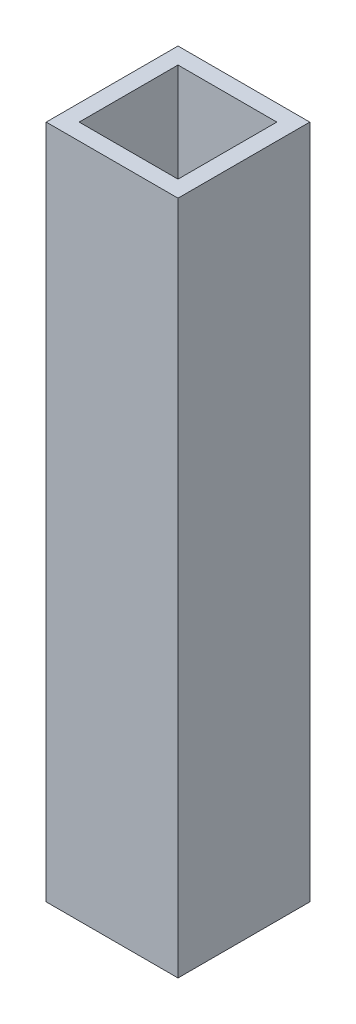
ISO-10303-21;
HEADER;
FILE_DESCRIPTION(('STEP AP214'),'2;1');
FILE_NAME('part.step','',(''),(''),'','','');
FILE_SCHEMA(('AUTOMOTIVE_DESIGN { 1 0 10303 214 1 1 1 1 }'));
ENDSEC;
DATA;
#1=APPLICATION_CONTEXT('core data for automotive mechanical design processes');
#2=APPLICATION_PROTOCOL_DEFINITION('international standard','automotive_design',2000,#1);
#3=PRODUCT_CONTEXT('',#1,'mechanical');
#4=PRODUCT('Part','Part','',(#3));
#5=PRODUCT_RELATED_PRODUCT_CATEGORY('part','',(#4));
#6=PRODUCT_DEFINITION_FORMATION('','',#4);
#7=PRODUCT_DEFINITION_CONTEXT('part definition',#1,'design');
#8=PRODUCT_DEFINITION('design','',#6,#7);
#9=PRODUCT_DEFINITION_SHAPE('','',#8);
#10=(LENGTH_UNIT() NAMED_UNIT(*) SI_UNIT(.MILLI.,.METRE.));
#11=(NAMED_UNIT(*) PLANE_ANGLE_UNIT() SI_UNIT($,.RADIAN.));
#12=(NAMED_UNIT(*) SI_UNIT($,.STERADIAN.) SOLID_ANGLE_UNIT());
#13=UNCERTAINTY_MEASURE_WITH_UNIT(LENGTH_MEASURE(1.E-05),#10,'distance_accuracy_value','');
#14=(GEOMETRIC_REPRESENTATION_CONTEXT(3) GLOBAL_UNCERTAINTY_ASSIGNED_CONTEXT((#13)) GLOBAL_UNIT_ASSIGNED_CONTEXT((#10,
#11,#12)) REPRESENTATION_CONTEXT('',''));
#15=CARTESIAN_POINT('',(0.,0.,0.));
#16=DIRECTION('',(0.,0.,1.));
#17=DIRECTION('',(1.,0.,0.));
#18=AXIS2_PLACEMENT_3D('',#15,#16,#17);
#19=CARTESIAN_POINT('',(0.,205.,0.));
#20=DIRECTION('',(0.,1.,0.));
#21=DIRECTION('',(0.,0.,1.));
#22=AXIS2_PLACEMENT_3D('',#19,#20,#21);
#23=PLANE('',#22);
#24=DIRECTION('',(0.,0.,1.));
#25=VECTOR('',#24,1.);
#26=CARTESIAN_POINT('',(-20.,205.,-20.));
#27=LINE('',#26,#25);
#28=CARTESIAN_POINT('',(-20.,205.,-20.));
#29=VERTEX_POINT('',#28);
#30=CARTESIAN_POINT('',(-20.,205.,20.));
#31=VERTEX_POINT('',#30);
#32=EDGE_CURVE('E138',#29,#31,#27,.T.);
#33=ORIENTED_EDGE('',*,*,#32,.T.);
#34=DIRECTION('',(1.,0.,0.));
#35=VECTOR('',#34,1.);
#36=CARTESIAN_POINT('',(-20.,205.,20.));
#37=LINE('',#36,#35);
#38=CARTESIAN_POINT('',(20.,205.,20.));
#39=VERTEX_POINT('',#38);
#40=EDGE_CURVE('E141',#31,#39,#37,.T.);
#41=ORIENTED_EDGE('',*,*,#40,.T.);
#42=DIRECTION('',(0.,0.,-1.));
#43=VECTOR('',#42,1.);
#44=CARTESIAN_POINT('',(20.,205.,-20.));
#45=LINE('',#44,#43);
#46=CARTESIAN_POINT('',(20.,205.,-20.));
#47=VERTEX_POINT('',#46);
#48=EDGE_CURVE('E144',#39,#47,#45,.T.);
#49=ORIENTED_EDGE('',*,*,#48,.T.);
#50=DIRECTION('',(-1.,0.,0.));
#51=VECTOR('',#50,1.);
#52=CARTESIAN_POINT('',(-20.,205.,-20.));
#53=LINE('',#52,#51);
#54=EDGE_CURVE('E146',#47,#29,#53,.T.);
#55=ORIENTED_EDGE('',*,*,#54,.T.);
#56=EDGE_LOOP('',(#33,#41,#49,#55));
#57=FACE_BOUND('',#56,.T.);
#58=DIRECTION('',(-1.,0.,0.));
#59=VECTOR('',#58,1.);
#60=CARTESIAN_POINT('',(-15.,205.,-15.));
#61=LINE('',#60,#59);
#62=CARTESIAN_POINT('',(15.,205.,-15.));
#63=VERTEX_POINT('',#62);
#64=CARTESIAN_POINT('',(-15.,205.,-15.));
#65=VERTEX_POINT('',#64);
#66=EDGE_CURVE('E110',#63,#65,#61,.T.);
#67=ORIENTED_EDGE('',*,*,#66,.F.);
#68=DIRECTION('',(0.,0.,-1.));
#69=VECTOR('',#68,1.);
#70=CARTESIAN_POINT('',(15.,205.,-15.));
#71=LINE('',#70,#69);
#72=CARTESIAN_POINT('',(15.,205.,15.));
#73=VERTEX_POINT('',#72);
#74=EDGE_CURVE('E102',#73,#63,#71,.T.);
#75=ORIENTED_EDGE('',*,*,#74,.F.);
#76=DIRECTION('',(1.,0.,0.));
#77=VECTOR('',#76,1.);
#78=CARTESIAN_POINT('',(-15.,205.,15.));
#79=LINE('',#78,#77);
#80=CARTESIAN_POINT('',(-15.,205.,15.));
#81=VERTEX_POINT('',#80);
#82=EDGE_CURVE('E124',#81,#73,#79,.T.);
#83=ORIENTED_EDGE('',*,*,#82,.F.);
#84=DIRECTION('',(0.,0.,1.));
#85=VECTOR('',#84,1.);
#86=CARTESIAN_POINT('',(-15.,205.,-15.));
#87=LINE('',#86,#85);
#88=EDGE_CURVE('E122',#65,#81,#87,.T.);
#89=ORIENTED_EDGE('',*,*,#88,.F.);
#90=EDGE_LOOP('',(#67,#75,#83,#89));
#91=FACE_BOUND('',#90,.T.);
#92=ADVANCED_FACE('F37',(#57,#91),#23,.T.);
#93=CARTESIAN_POINT('',(0.,0.,0.));
#94=DIRECTION('',(0.,1.,0.));
#95=DIRECTION('',(0.,0.,1.));
#96=AXIS2_PLACEMENT_3D('',#93,#94,#95);
#97=PLANE('',#96);
#98=DIRECTION('',(0.,0.,1.));
#99=VECTOR('',#98,1.);
#100=CARTESIAN_POINT('',(-20.,0.,-20.));
#101=LINE('',#100,#99);
#102=CARTESIAN_POINT('',(-20.,0.,-20.));
#103=VERTEX_POINT('',#102);
#104=CARTESIAN_POINT('',(-20.,0.,20.));
#105=VERTEX_POINT('',#104);
#106=EDGE_CURVE('E118',#103,#105,#101,.T.);
#107=ORIENTED_EDGE('',*,*,#106,.F.);
#108=DIRECTION('',(-1.,0.,0.));
#109=VECTOR('',#108,1.);
#110=CARTESIAN_POINT('',(-20.,0.,-20.));
#111=LINE('',#110,#109);
#112=CARTESIAN_POINT('',(20.,0.,-20.));
#113=VERTEX_POINT('',#112);
#114=EDGE_CURVE('E142',#113,#103,#111,.T.);
#115=ORIENTED_EDGE('',*,*,#114,.F.);
#116=DIRECTION('',(0.,0.,-1.));
#117=VECTOR('',#116,1.);
#118=CARTESIAN_POINT('',(20.,0.,-20.));
#119=LINE('',#118,#117);
#120=CARTESIAN_POINT('',(20.,0.,20.));
#121=VERTEX_POINT('',#120);
#122=EDGE_CURVE('E153',#121,#113,#119,.T.);
#123=ORIENTED_EDGE('',*,*,#122,.F.);
#124=DIRECTION('',(1.,0.,0.));
#125=VECTOR('',#124,1.);
#126=CARTESIAN_POINT('',(-20.,0.,20.));
#127=LINE('',#126,#125);
#128=EDGE_CURVE('E151',#105,#121,#127,.T.);
#129=ORIENTED_EDGE('',*,*,#128,.F.);
#130=EDGE_LOOP('',(#107,#115,#123,#129));
#131=FACE_BOUND('',#130,.T.);
#132=DIRECTION('',(0.,0.,-1.));
#133=VECTOR('',#132,1.);
#134=CARTESIAN_POINT('',(15.,0.,-15.));
#135=LINE('',#134,#133);
#136=CARTESIAN_POINT('',(15.,0.,15.));
#137=VERTEX_POINT('',#136);
#138=CARTESIAN_POINT('',(15.,0.,-15.));
#139=VERTEX_POINT('',#138);
#140=EDGE_CURVE('E60',#137,#139,#135,.T.);
#141=ORIENTED_EDGE('',*,*,#140,.T.);
#142=DIRECTION('',(-1.,0.,0.));
#143=VECTOR('',#142,1.);
#144=CARTESIAN_POINT('',(-15.,0.,-15.));
#145=LINE('',#144,#143);
#146=CARTESIAN_POINT('',(-15.,0.,-15.));
#147=VERTEX_POINT('',#146);
#148=EDGE_CURVE('E117',#139,#147,#145,.T.);
#149=ORIENTED_EDGE('',*,*,#148,.T.);
#150=DIRECTION('',(0.,0.,1.));
#151=VECTOR('',#150,1.);
#152=CARTESIAN_POINT('',(-15.,0.,-15.));
#153=LINE('',#152,#151);
#154=CARTESIAN_POINT('',(-15.,0.,15.));
#155=VERTEX_POINT('',#154);
#156=EDGE_CURVE('E130',#147,#155,#153,.T.);
#157=ORIENTED_EDGE('',*,*,#156,.T.);
#158=DIRECTION('',(1.,0.,0.));
#159=VECTOR('',#158,1.);
#160=CARTESIAN_POINT('',(-15.,0.,15.));
#161=LINE('',#160,#159);
#162=EDGE_CURVE('E111',#155,#137,#161,.T.);
#163=ORIENTED_EDGE('',*,*,#162,.T.);
#164=EDGE_LOOP('',(#141,#149,#157,#163));
#165=FACE_BOUND('',#164,.T.);
#166=ADVANCED_FACE('F171',(#131,#165),#97,.F.);
#167=CARTESIAN_POINT('',(-20.,205.,-20.));
#168=DIRECTION('',(1.,0.,0.));
#169=DIRECTION('',(0.,0.,-1.));
#170=AXIS2_PLACEMENT_3D('',#167,#168,#169);
#171=PLANE('',#170);
#172=ORIENTED_EDGE('',*,*,#106,.T.);
#173=DIRECTION('',(0.,-1.,0.));
#174=VECTOR('',#173,1.);
#175=CARTESIAN_POINT('',(-20.,205.,20.));
#176=LINE('',#175,#174);
#177=EDGE_CURVE('E11',#31,#105,#176,.T.);
#178=ORIENTED_EDGE('',*,*,#177,.F.);
#179=ORIENTED_EDGE('',*,*,#32,.F.);
#180=DIRECTION('',(0.,-1.,0.));
#181=VECTOR('',#180,1.);
#182=CARTESIAN_POINT('',(-20.,205.,-20.));
#183=LINE('',#182,#181);
#184=EDGE_CURVE('E148',#29,#103,#183,.T.);
#185=ORIENTED_EDGE('',*,*,#184,.T.);
#186=EDGE_LOOP('',(#172,#178,#179,#185));
#187=FACE_BOUND('',#186,.T.);
#188=ADVANCED_FACE('F39',(#187),#171,.F.);
#189=CARTESIAN_POINT('',(-20.,205.,20.));
#190=DIRECTION('',(0.,0.,-1.));
#191=DIRECTION('',(-1.,0.,0.));
#192=AXIS2_PLACEMENT_3D('',#189,#190,#191);
#193=PLANE('',#192);
#194=ORIENTED_EDGE('',*,*,#128,.T.);
#195=DIRECTION('',(0.,-1.,0.));
#196=VECTOR('',#195,1.);
#197=CARTESIAN_POINT('',(20.,205.,20.));
#198=LINE('',#197,#196);
#199=EDGE_CURVE('E45',#39,#121,#198,.T.);
#200=ORIENTED_EDGE('',*,*,#199,.F.);
#201=ORIENTED_EDGE('',*,*,#40,.F.);
#202=ORIENTED_EDGE('',*,*,#177,.T.);
#203=EDGE_LOOP('',(#194,#200,#201,#202));
#204=FACE_BOUND('',#203,.T.);
#205=ADVANCED_FACE('F181',(#204),#193,.F.);
#206=CARTESIAN_POINT('',(20.,205.,-20.));
#207=DIRECTION('',(-1.,0.,0.));
#208=DIRECTION('',(0.,0.,1.));
#209=AXIS2_PLACEMENT_3D('',#206,#207,#208);
#210=PLANE('',#209);
#211=ORIENTED_EDGE('',*,*,#122,.T.);
#212=DIRECTION('',(0.,-1.,0.));
#213=VECTOR('',#212,1.);
#214=CARTESIAN_POINT('',(20.,205.,-20.));
#215=LINE('',#214,#213);
#216=EDGE_CURVE('E158',#47,#113,#215,.T.);
#217=ORIENTED_EDGE('',*,*,#216,.F.);
#218=ORIENTED_EDGE('',*,*,#48,.F.);
#219=ORIENTED_EDGE('',*,*,#199,.T.);
#220=EDGE_LOOP('',(#211,#217,#218,#219));
#221=FACE_BOUND('',#220,.T.);
#222=ADVANCED_FACE('F165',(#221),#210,.F.);
#223=CARTESIAN_POINT('',(-20.,205.,-20.));
#224=DIRECTION('',(0.,0.,1.));
#225=DIRECTION('',(1.,0.,0.));
#226=AXIS2_PLACEMENT_3D('',#223,#224,#225);
#227=PLANE('',#226);
#228=ORIENTED_EDGE('',*,*,#114,.T.);
#229=ORIENTED_EDGE('',*,*,#184,.F.);
#230=ORIENTED_EDGE('',*,*,#54,.F.);
#231=ORIENTED_EDGE('',*,*,#216,.T.);
#232=EDGE_LOOP('',(#228,#229,#230,#231));
#233=FACE_BOUND('',#232,.T.);
#234=ADVANCED_FACE('F175',(#233),#227,.F.);
#235=CARTESIAN_POINT('',(15.,205.,-15.));
#236=DIRECTION('',(-1.,0.,0.));
#237=DIRECTION('',(0.,0.,1.));
#238=AXIS2_PLACEMENT_3D('',#235,#236,#237);
#239=PLANE('',#238);
#240=ORIENTED_EDGE('',*,*,#140,.F.);
#241=DIRECTION('',(0.,-1.,0.));
#242=VECTOR('',#241,1.);
#243=CARTESIAN_POINT('',(15.,205.,15.));
#244=LINE('',#243,#242);
#245=EDGE_CURVE('E106',#73,#137,#244,.T.);
#246=ORIENTED_EDGE('',*,*,#245,.F.);
#247=ORIENTED_EDGE('',*,*,#74,.T.);
#248=DIRECTION('',(0.,-1.,0.));
#249=VECTOR('',#248,1.);
#250=CARTESIAN_POINT('',(15.,205.,-15.));
#251=LINE('',#250,#249);
#252=EDGE_CURVE('E105',#63,#139,#251,.T.);
#253=ORIENTED_EDGE('',*,*,#252,.T.);
#254=EDGE_LOOP('',(#240,#246,#247,#253));
#255=FACE_BOUND('',#254,.T.);
#256=ADVANCED_FACE('F104',(#255),#239,.T.);
#257=CARTESIAN_POINT('',(-15.,205.,-15.));
#258=DIRECTION('',(0.,0.,1.));
#259=DIRECTION('',(1.,0.,0.));
#260=AXIS2_PLACEMENT_3D('',#257,#258,#259);
#261=PLANE('',#260);
#262=ORIENTED_EDGE('',*,*,#148,.F.);
#263=ORIENTED_EDGE('',*,*,#252,.F.);
#264=ORIENTED_EDGE('',*,*,#66,.T.);
#265=DIRECTION('',(0.,-1.,0.));
#266=VECTOR('',#265,1.);
#267=CARTESIAN_POINT('',(-15.,205.,-15.));
#268=LINE('',#267,#266);
#269=EDGE_CURVE('E119',#65,#147,#268,.T.);
#270=ORIENTED_EDGE('',*,*,#269,.T.);
#271=EDGE_LOOP('',(#262,#263,#264,#270));
#272=FACE_BOUND('',#271,.T.);
#273=ADVANCED_FACE('F114',(#272),#261,.T.);
#274=CARTESIAN_POINT('',(-15.,205.,-15.));
#275=DIRECTION('',(1.,0.,0.));
#276=DIRECTION('',(0.,0.,-1.));
#277=AXIS2_PLACEMENT_3D('',#274,#275,#276);
#278=PLANE('',#277);
#279=ORIENTED_EDGE('',*,*,#156,.F.);
#280=ORIENTED_EDGE('',*,*,#269,.F.);
#281=ORIENTED_EDGE('',*,*,#88,.T.);
#282=DIRECTION('',(0.,-1.,0.));
#283=VECTOR('',#282,1.);
#284=CARTESIAN_POINT('',(-15.,205.,15.));
#285=LINE('',#284,#283);
#286=EDGE_CURVE('E52',#81,#155,#285,.T.);
#287=ORIENTED_EDGE('',*,*,#286,.T.);
#288=EDGE_LOOP('',(#279,#280,#281,#287));
#289=FACE_BOUND('',#288,.T.);
#290=ADVANCED_FACE('F204',(#289),#278,.T.);
#291=CARTESIAN_POINT('',(-15.,205.,15.));
#292=DIRECTION('',(0.,0.,-1.));
#293=DIRECTION('',(-1.,0.,0.));
#294=AXIS2_PLACEMENT_3D('',#291,#292,#293);
#295=PLANE('',#294);
#296=ORIENTED_EDGE('',*,*,#162,.F.);
#297=ORIENTED_EDGE('',*,*,#286,.F.);
#298=ORIENTED_EDGE('',*,*,#82,.T.);
#299=ORIENTED_EDGE('',*,*,#245,.T.);
#300=EDGE_LOOP('',(#296,#297,#298,#299));
#301=FACE_BOUND('',#300,.T.);
#302=ADVANCED_FACE('F208',(#301),#295,.T.);
#303=CLOSED_SHELL('',(#92,#166,#188,#205,#222,#234,#256,#273,#290,#302));
#304=MANIFOLD_SOLID_BREP('B2',#303);
#305=ADVANCED_BREP_SHAPE_REPRESENTATION('',(#18,#304),#14);
#306=SHAPE_DEFINITION_REPRESENTATION(#9,#305);
ENDSEC;
END-ISO-10303-21;
